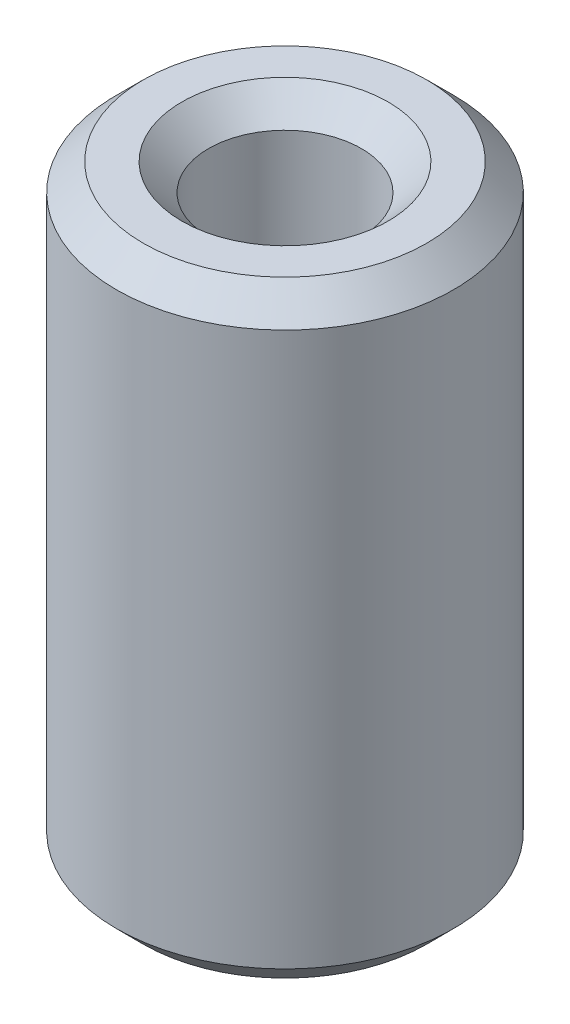
ISO-10303-21;
HEADER;
FILE_DESCRIPTION(('STEP AP214'),'2;1');
FILE_NAME('part.step','',(''),(''),'','','');
FILE_SCHEMA(('AUTOMOTIVE_DESIGN { 1 0 10303 214 1 1 1 1 }'));
ENDSEC;
DATA;
#1=APPLICATION_CONTEXT('core data for automotive mechanical design processes');
#2=APPLICATION_PROTOCOL_DEFINITION('international standard','automotive_design',2000,#1);
#3=PRODUCT_CONTEXT('',#1,'mechanical');
#4=PRODUCT('Part','Part','',(#3));
#5=PRODUCT_RELATED_PRODUCT_CATEGORY('part','',(#4));
#6=PRODUCT_DEFINITION_FORMATION('','',#4);
#7=PRODUCT_DEFINITION_CONTEXT('part definition',#1,'design');
#8=PRODUCT_DEFINITION('design','',#6,#7);
#9=PRODUCT_DEFINITION_SHAPE('','',#8);
#10=(LENGTH_UNIT() NAMED_UNIT(*) SI_UNIT(.MILLI.,.METRE.));
#11=(NAMED_UNIT(*) PLANE_ANGLE_UNIT() SI_UNIT($,.RADIAN.));
#12=(NAMED_UNIT(*) SI_UNIT($,.STERADIAN.) SOLID_ANGLE_UNIT());
#13=UNCERTAINTY_MEASURE_WITH_UNIT(LENGTH_MEASURE(1.E-05),#10,'distance_accuracy_value','');
#14=(GEOMETRIC_REPRESENTATION_CONTEXT(3) GLOBAL_UNCERTAINTY_ASSIGNED_CONTEXT((#13)) GLOBAL_UNIT_ASSIGNED_CONTEXT((#10,
#11,#12)) REPRESENTATION_CONTEXT('',''));
#15=CARTESIAN_POINT('',(0.,0.,0.));
#16=DIRECTION('',(0.,0.,1.));
#17=DIRECTION('',(1.,0.,0.));
#18=AXIS2_PLACEMENT_3D('',#15,#16,#17);
#19=CARTESIAN_POINT('',(0.,81.0309155370491,0.));
#20=DIRECTION('',(0.,-1.,0.));
#21=DIRECTION('',(0.,0.,-1.));
#22=AXIS2_PLACEMENT_3D('',#19,#20,#21);
#23=CYLINDRICAL_SURFACE('',#22,22.5);
#24=CARTESIAN_POINT('',(0.,3.59025679632935,0.));
#25=DIRECTION('',(0.,1.,0.));
#26=DIRECTION('',(0.,0.,1.));
#27=AXIS2_PLACEMENT_3D('',#24,#25,#26);
#28=CIRCLE('',#27,22.5);
#29=CARTESIAN_POINT('',(0.,3.59025679632935,22.5));
#30=VERTEX_POINT('',#29);
#31=EDGE_CURVE('E10',#30,#30,#28,.T.);
#32=ORIENTED_EDGE('',*,*,#31,.T.);
#33=EDGE_LOOP('',(#32));
#34=FACE_BOUND('',#33,.T.);
#35=CARTESIAN_POINT('',(0.,77.4506810497996,0.));
#36=DIRECTION('',(0.,1.,0.));
#37=DIRECTION('',(0.,0.,1.));
#38=AXIS2_PLACEMENT_3D('',#35,#36,#37);
#39=CIRCLE('',#38,22.5);
#40=CARTESIAN_POINT('',(0.,77.4506810497996,-22.5));
#41=VERTEX_POINT('',#40);
#42=EDGE_CURVE('E50',#41,#41,#39,.F.);
#43=ORIENTED_EDGE('',*,*,#42,.T.);
#44=EDGE_LOOP('',(#43));
#45=FACE_BOUND('',#44,.T.);
#46=ADVANCED_FACE('F39',(#34,#45),#23,.T.);
#47=CARTESIAN_POINT('',(0.,81.0309155370491,0.));
#48=DIRECTION('',(0.,1.,0.));
#49=DIRECTION('',(0.,0.,1.));
#50=AXIS2_PLACEMENT_3D('',#47,#48,#49);
#51=PLANE('',#50);
#52=CARTESIAN_POINT('',(0.,81.0309155370491,0.));
#53=DIRECTION('',(0.,1.,0.));
#54=DIRECTION('',(0.,0.,1.));
#55=AXIS2_PLACEMENT_3D('',#52,#53,#54);
#56=CIRCLE('',#55,13.7794093148793);
#57=CARTESIAN_POINT('',(0.,81.0309155370491,13.7794093148793));
#58=VERTEX_POINT('',#57);
#59=EDGE_CURVE('E58',#58,#58,#56,.F.);
#60=ORIENTED_EDGE('',*,*,#59,.T.);
#61=EDGE_LOOP('',(#60));
#62=FACE_BOUND('',#61,.T.);
#63=CARTESIAN_POINT('',(0.,81.0309155370491,0.));
#64=DIRECTION('',(0.,1.,0.));
#65=DIRECTION('',(0.,0.,1.));
#66=AXIS2_PLACEMENT_3D('',#63,#64,#65);
#67=CIRCLE('',#66,18.9097432036707);
#68=CARTESIAN_POINT('',(0.,81.0309155370491,-18.9097432036707));
#69=VERTEX_POINT('',#68);
#70=EDGE_CURVE('E61',#69,#69,#67,.T.);
#71=ORIENTED_EDGE('',*,*,#70,.T.);
#72=EDGE_LOOP('',(#71));
#73=FACE_BOUND('',#72,.T.);
#74=ADVANCED_FACE('F88',(#62,#73),#51,.T.);
#75=CARTESIAN_POINT('',(0.,0.,0.));
#76=DIRECTION('',(0.,1.,0.));
#77=DIRECTION('',(0.,0.,1.));
#78=AXIS2_PLACEMENT_3D('',#75,#76,#77);
#79=PLANE('',#78);
#80=CARTESIAN_POINT('',(0.,0.,0.));
#81=DIRECTION('',(0.,1.,0.));
#82=DIRECTION('',(0.,0.,1.));
#83=AXIS2_PLACEMENT_3D('',#80,#81,#82);
#84=CIRCLE('',#83,13.7894316239591);
#85=CARTESIAN_POINT('',(0.,0.,13.7894316239591));
#86=VERTEX_POINT('',#85);
#87=EDGE_CURVE('E51',#86,#86,#84,.T.);
#88=ORIENTED_EDGE('',*,*,#87,.T.);
#89=EDGE_LOOP('',(#88));
#90=FACE_BOUND('',#89,.T.);
#91=CARTESIAN_POINT('',(0.,0.,0.));
#92=DIRECTION('',(0.,1.,0.));
#93=DIRECTION('',(0.,0.,1.));
#94=AXIS2_PLACEMENT_3D('',#91,#92,#93);
#95=CIRCLE('',#94,18.9197655127505);
#96=CARTESIAN_POINT('',(0.,0.,18.9197655127505));
#97=VERTEX_POINT('',#96);
#98=EDGE_CURVE('E54',#97,#97,#95,.F.);
#99=ORIENTED_EDGE('',*,*,#98,.T.);
#100=EDGE_LOOP('',(#99));
#101=FACE_BOUND('',#100,.T.);
#102=ADVANCED_FACE('F83',(#90,#101),#79,.F.);
#103=CARTESIAN_POINT('',(0.,81.0309155370491,0.));
#104=DIRECTION('',(0.,-1.,0.));
#105=DIRECTION('',(0.,0.,-1.));
#106=AXIS2_PLACEMENT_3D('',#103,#104,#105);
#107=CYLINDRICAL_SURFACE('',#106,10.1991748276297);
#108=CARTESIAN_POINT('',(0.,77.4406587407197,0.));
#109=DIRECTION('',(0.,1.,0.));
#110=DIRECTION('',(0.,0.,1.));
#111=AXIS2_PLACEMENT_3D('',#108,#109,#110);
#112=CIRCLE('',#111,10.1991748276297);
#113=CARTESIAN_POINT('',(0.,77.4406587407197,10.1991748276297));
#114=VERTEX_POINT('',#113);
#115=EDGE_CURVE('E67',#114,#114,#112,.T.);
#116=ORIENTED_EDGE('',*,*,#115,.T.);
#117=EDGE_LOOP('',(#116));
#118=FACE_BOUND('',#117,.T.);
#119=CARTESIAN_POINT('',(0.,3.58023448724952,0.));
#120=DIRECTION('',(0.,1.,0.));
#121=DIRECTION('',(0.,0.,1.));
#122=AXIS2_PLACEMENT_3D('',#119,#120,#121);
#123=CIRCLE('',#122,10.1991748276297);
#124=CARTESIAN_POINT('',(0.,3.58023448724952,10.1991748276297));
#125=VERTEX_POINT('',#124);
#126=EDGE_CURVE('E69',#125,#125,#123,.F.);
#127=ORIENTED_EDGE('',*,*,#126,.T.);
#128=EDGE_LOOP('',(#127));
#129=FACE_BOUND('',#128,.T.);
#130=ADVANCED_FACE('F71',(#118,#129),#107,.F.);
#131=CARTESIAN_POINT('',(0.,77.4406587407197,0.));
#132=DIRECTION('',(0.,1.,0.));
#133=DIRECTION('',(0.,0.,1.));
#134=AXIS2_PLACEMENT_3D('',#131,#132,#133);
#135=CONICAL_SURFACE('',#134,10.1991748276297,0.784000448491048);
#136=ORIENTED_EDGE('',*,*,#59,.F.);
#137=EDGE_LOOP('',(#136));
#138=FACE_BOUND('',#137,.T.);
#139=ORIENTED_EDGE('',*,*,#115,.F.);
#140=EDGE_LOOP('',(#139));
#141=FACE_BOUND('',#140,.T.);
#142=ADVANCED_FACE('F77',(#138,#141),#135,.F.);
#143=CARTESIAN_POINT('',(0.,0.,0.));
#144=DIRECTION('',(0.,-1.,0.));
#145=DIRECTION('',(0.,0.,-1.));
#146=AXIS2_PLACEMENT_3D('',#143,#144,#145);
#147=CONICAL_SURFACE('',#146,13.7894316239591,0.78679587830385);
#148=ORIENTED_EDGE('',*,*,#126,.F.);
#149=EDGE_LOOP('',(#148));
#150=FACE_BOUND('',#149,.T.);
#151=ORIENTED_EDGE('',*,*,#87,.F.);
#152=EDGE_LOOP('',(#151));
#153=FACE_BOUND('',#152,.T.);
#154=ADVANCED_FACE('F73',(#150,#153),#147,.F.);
#155=CARTESIAN_POINT('',(0.,3.59025679632935,0.));
#156=DIRECTION('',(0.,1.,0.));
#157=DIRECTION('',(0.,0.,1.));
#158=AXIS2_PLACEMENT_3D('',#155,#156,#157);
#159=CONICAL_SURFACE('',#158,22.5,0.784000448491051);
#160=ORIENTED_EDGE('',*,*,#98,.F.);
#161=EDGE_LOOP('',(#160));
#162=FACE_BOUND('',#161,.T.);
#163=ORIENTED_EDGE('',*,*,#31,.F.);
#164=EDGE_LOOP('',(#163));
#165=FACE_BOUND('',#164,.T.);
#166=ADVANCED_FACE('F76',(#162,#165),#159,.T.);
#167=CARTESIAN_POINT('',(0.,81.0309155370491,0.));
#168=DIRECTION('',(0.,-1.,0.));
#169=DIRECTION('',(0.,0.,-1.));
#170=AXIS2_PLACEMENT_3D('',#167,#168,#169);
#171=CONICAL_SURFACE('',#170,18.9097432036707,0.786795878303847);
#172=CARTESIAN_POINT('',(0.,77.4506810497996,-22.5));
#173=CARTESIAN_POINT('',(0.,77.4879751590418,-22.4626014917049));
#174=CARTESIAN_POINT('',(0.,77.525269268284,-22.4252029834098));
#175=CARTESIAN_POINT('',(0.,77.5998574867683,-22.3504059668196));
#176=CARTESIAN_POINT('',(0.,77.6371515960105,-22.3130074585245));
#177=CARTESIAN_POINT('',(0.,77.7117398144949,-22.2382104419343));
#178=CARTESIAN_POINT('',(0.,77.7490339237371,-22.2008119336392));
#179=CARTESIAN_POINT('',(0.,77.8236221422214,-22.126014917049));
#180=CARTESIAN_POINT('',(0.,77.8609162514636,-22.0886164087539));
#181=CARTESIAN_POINT('',(0.,77.935504469948,-22.0138193921638));
#182=CARTESIAN_POINT('',(0.,77.9727985791902,-21.9764208838687));
#183=CARTESIAN_POINT('',(0.,78.0473867976745,-21.9016238672785));
#184=CARTESIAN_POINT('',(0.,78.0846809069167,-21.8642253589834));
#185=CARTESIAN_POINT('',(0.,78.1592691254011,-21.7894283423932));
#186=CARTESIAN_POINT('',(0.,78.1965632346432,-21.7520298340981));
#187=CARTESIAN_POINT('',(0.,78.2711514531276,-21.6772328175079));
#188=CARTESIAN_POINT('',(0.,78.3084455623698,-21.6398343092128));
#189=CARTESIAN_POINT('',(0.,78.3830337808541,-21.5650372926226));
#190=CARTESIAN_POINT('',(0.,78.4203278900963,-21.5276387843275));
#191=CARTESIAN_POINT('',(0.,78.4949161085807,-21.4528417677373));
#192=CARTESIAN_POINT('',(0.,78.5322102178229,-21.4154432594422));
#193=CARTESIAN_POINT('',(0.,78.6067984363072,-21.340646242852));
#194=CARTESIAN_POINT('',(0.,78.6440925455494,-21.3032477345569));
#195=CARTESIAN_POINT('',(0.,78.7186807640338,-21.2284507179667));
#196=CARTESIAN_POINT('',(0.,78.755974873276,-21.1910522096716));
#197=CARTESIAN_POINT('',(0.,78.8305630917603,-21.1162551930814));
#198=CARTESIAN_POINT('',(0.,78.8678572010025,-21.0788566847863));
#199=CARTESIAN_POINT('',(0.,78.9424454194869,-21.0040596681961));
#200=CARTESIAN_POINT('',(0.,78.9797395287291,-20.966661159901));
#201=CARTESIAN_POINT('',(0.,79.0543277472134,-20.8918641433108));
#202=CARTESIAN_POINT('',(0.,79.0916218564556,-20.8544656350158));
#203=CARTESIAN_POINT('',(0.,79.16621007494,-20.7796686184256));
#204=CARTESIAN_POINT('',(0.,79.2035041841822,-20.7422701101305));
#205=CARTESIAN_POINT('',(0.,79.2780924026665,-20.6674730935403));
#206=CARTESIAN_POINT('',(0.,79.3153865119087,-20.6300745852452));
#207=CARTESIAN_POINT('',(0.,79.389974730393,-20.555277568655));
#208=CARTESIAN_POINT('',(0.,79.4272688396352,-20.5178790603599));
#209=CARTESIAN_POINT('',(0.,79.5018570581196,-20.4430820437697));
#210=CARTESIAN_POINT('',(0.,79.5391511673618,-20.4056835354746));
#211=CARTESIAN_POINT('',(0.,79.6137393858461,-20.3308865188844));
#212=CARTESIAN_POINT('',(0.,79.6510334950883,-20.2934880105893));
#213=CARTESIAN_POINT('',(0.,79.7256217135727,-20.2186909939991));
#214=CARTESIAN_POINT('',(0.,79.7629158228149,-20.181292485704));
#215=CARTESIAN_POINT('',(0.,79.8375040412992,-20.1064954691138));
#216=CARTESIAN_POINT('',(0.,79.8747981505414,-20.0690969608187));
#217=CARTESIAN_POINT('',(0.,79.9493863690258,-19.9942999442285));
#218=CARTESIAN_POINT('',(0.,79.986680478268,-19.9569014359334));
#219=CARTESIAN_POINT('',(0.,80.0612686967523,-19.8821044193432));
#220=CARTESIAN_POINT('',(0.,80.0985628059945,-19.8447059110481));
#221=CARTESIAN_POINT('',(0.,80.1731510244789,-19.7699088944579));
#222=CARTESIAN_POINT('',(0.,80.2104451337211,-19.7325103861628));
#223=CARTESIAN_POINT('',(0.,80.2850333522054,-19.6577133695727));
#224=CARTESIAN_POINT('',(0.,80.3223274614476,-19.6203148612776));
#225=CARTESIAN_POINT('',(0.,80.396915679932,-19.5455178446874));
#226=CARTESIAN_POINT('',(0.,80.4342097891742,-19.5081193363923));
#227=CARTESIAN_POINT('',(0.,80.5087980076585,-19.4333223198021));
#228=CARTESIAN_POINT('',(0.,80.5460921169007,-19.395923811507));
#229=CARTESIAN_POINT('',(0.,80.6206803353851,-19.3211267949168));
#230=CARTESIAN_POINT('',(0.,80.6579744446273,-19.2837282866217));
#231=CARTESIAN_POINT('',(0.,80.7325626631116,-19.2089312700315));
#232=CARTESIAN_POINT('',(0.,80.7698567723538,-19.1715327617364));
#233=CARTESIAN_POINT('',(0.,80.8444449908382,-19.0967357451462));
#234=CARTESIAN_POINT('',(0.,80.8817391000804,-19.0593372368511));
#235=CARTESIAN_POINT('',(0.,80.9563273185647,-18.9845402202609));
#236=CARTESIAN_POINT('',(0.,80.9936214278069,-18.9471417119658));
#237=CARTESIAN_POINT('',(0.,81.0309155370491,-18.9097432036707));
#238=B_SPLINE_CURVE_WITH_KNOTS('',3,(#172,#173,#174,#175,#176,#177,#178,#179,#180,#181,#182,
#183,#184,#185,#186,#187,#188,#189,#190,#191,#192,#193,#194,#195,#196,#197,#198,#199,#200,#201,
#202,#203,#204,#205,#206,#207,#208,#209,#210,#211,#212,#213,#214,#215,#216,#217,#218,#219,#220,
#221,#222,#223,#224,#225,#226,#227,#228,#229,#230,#231,#232,#233,#234,#235,#236,#237),
.UNSPECIFIED.,.F.,.F.,(4,2,2,2,2,2,2,2,2,2,2,2,2,2,2,2,2,2,2,2,2,2,2,2,2,2,2,2,2,2,2,2,4),(0.,
0.158447123867227,0.316894247734455,0.47534137160168,0.633788495468907,0.792235619336135,
0.950682743203362,1.10912986707059,1.26757699093781,1.42602411480503,1.58447123867226,
1.74291836253949,1.90136548640672,2.05981261027394,2.21825973414117,2.3767068580084,
2.53515398187562,2.69360110574284,2.85204822961007,3.0104953534773,3.16894247734453,
3.32738960121175,3.48583672507898,3.64428384894621,3.80273097281344,3.96117809668065,
4.11962522054788,4.27807234441511,4.43651946828234,4.59496659214956,4.75341371601679,
4.91186083988402,5.07030796375124),.UNSPECIFIED.);
#239=EDGE_CURVE('BSEAM45',#41,#69,#238,.T.);
#240=ORIENTED_EDGE('',*,*,#42,.F.);
#241=ORIENTED_EDGE('',*,*,#70,.F.);
#242=ORIENTED_EDGE('',*,*,#239,.T.);
#243=ORIENTED_EDGE('',*,*,#239,.F.);
#244=EDGE_LOOP('',(#240,#242,#241,#243));
#245=FACE_BOUND('',#244,.T.);
#246=ADVANCED_FACE('F45',(#245),#171,.T.);
#247=CLOSED_SHELL('',(#46,#74,#102,#130,#142,#154,#166,#246));
#248=MANIFOLD_SOLID_BREP('B2',#247);
#249=ADVANCED_BREP_SHAPE_REPRESENTATION('',(#18,#248),#14);
#250=SHAPE_DEFINITION_REPRESENTATION(#9,#249);
ENDSEC;
END-ISO-10303-21;
